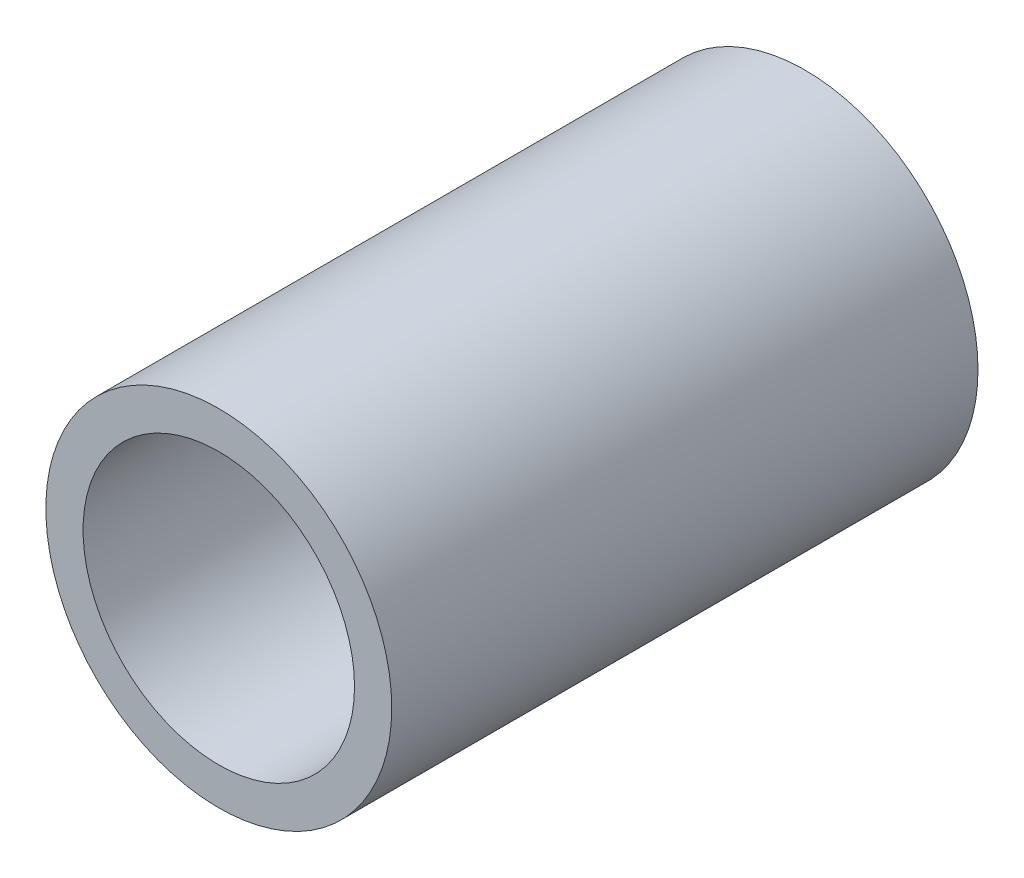
ISO-10303-21;
HEADER;
FILE_DESCRIPTION(('STEP AP214'),'2;1');
FILE_NAME('part.step','',(''),(''),'','','');
FILE_SCHEMA(('AUTOMOTIVE_DESIGN { 1 0 10303 214 1 1 1 1 }'));
ENDSEC;
DATA;
#1=APPLICATION_CONTEXT('core data for automotive mechanical design processes');
#2=APPLICATION_PROTOCOL_DEFINITION('international standard','automotive_design',2000,#1);
#3=PRODUCT_CONTEXT('',#1,'mechanical');
#4=PRODUCT('Part','Part','',(#3));
#5=PRODUCT_RELATED_PRODUCT_CATEGORY('part','',(#4));
#6=PRODUCT_DEFINITION_FORMATION('','',#4);
#7=PRODUCT_DEFINITION_CONTEXT('part definition',#1,'design');
#8=PRODUCT_DEFINITION('design','',#6,#7);
#9=PRODUCT_DEFINITION_SHAPE('','',#8);
#10=(LENGTH_UNIT() NAMED_UNIT(*) SI_UNIT(.MILLI.,.METRE.));
#11=(NAMED_UNIT(*) PLANE_ANGLE_UNIT() SI_UNIT($,.RADIAN.));
#12=(NAMED_UNIT(*) SI_UNIT($,.STERADIAN.) SOLID_ANGLE_UNIT());
#13=UNCERTAINTY_MEASURE_WITH_UNIT(LENGTH_MEASURE(1.E-05),#10,'distance_accuracy_value','');
#14=(GEOMETRIC_REPRESENTATION_CONTEXT(3) GLOBAL_UNCERTAINTY_ASSIGNED_CONTEXT((#13)) GLOBAL_UNIT_ASSIGNED_CONTEXT((#10,
#11,#12)) REPRESENTATION_CONTEXT('',''));
#15=CARTESIAN_POINT('',(0.,0.,0.));
#16=DIRECTION('',(0.,0.,1.));
#17=DIRECTION('',(1.,0.,0.));
#18=AXIS2_PLACEMENT_3D('',#15,#16,#17);
#19=CARTESIAN_POINT('',(0.,0.,762.));
#20=DIRECTION('',(0.,0.,-1.));
#21=DIRECTION('',(-1.,0.,0.));
#22=AXIS2_PLACEMENT_3D('',#19,#20,#21);
#23=CYLINDRICAL_SURFACE('',#22,13.335);
#24=CARTESIAN_POINT('',(0.,0.,-762.));
#25=DIRECTION('',(0.,0.,1.));
#26=DIRECTION('',(1.,0.,0.));
#27=AXIS2_PLACEMENT_3D('',#24,#25,#26);
#28=CIRCLE('',#27,13.335);
#29=CARTESIAN_POINT('',(13.335,0.,-762.));
#30=VERTEX_POINT('',#29);
#31=EDGE_CURVE('E11',#30,#30,#28,.T.);
#32=ORIENTED_EDGE('',*,*,#31,.T.);
#33=EDGE_LOOP('',(#32));
#34=FACE_BOUND('',#33,.T.);
#35=CARTESIAN_POINT('',(0.,0.,-716.7969));
#36=DIRECTION('',(0.,0.,1.));
#37=DIRECTION('',(1.,0.,0.));
#38=AXIS2_PLACEMENT_3D('',#35,#36,#37);
#39=CIRCLE('',#38,13.335);
#40=CARTESIAN_POINT('',(13.335,0.,-716.7969));
#41=VERTEX_POINT('',#40);
#42=EDGE_CURVE('E58',#41,#41,#39,.F.);
#43=ORIENTED_EDGE('',*,*,#42,.T.);
#44=EDGE_LOOP('',(#43));
#45=FACE_BOUND('',#44,.T.);
#46=ADVANCED_FACE('F43',(#34,#45),#23,.T.);
#47=CARTESIAN_POINT('',(0.,0.,762.));
#48=DIRECTION('',(0.,0.,-1.));
#49=DIRECTION('',(-1.,0.,0.));
#50=AXIS2_PLACEMENT_3D('',#47,#48,#49);
#51=CYLINDRICAL_SURFACE('',#50,10.4648);
#52=CARTESIAN_POINT('',(0.,0.,-762.));
#53=DIRECTION('',(0.,0.,1.));
#54=DIRECTION('',(1.,0.,0.));
#55=AXIS2_PLACEMENT_3D('',#52,#53,#54);
#56=CIRCLE('',#55,10.4648);
#57=CARTESIAN_POINT('',(10.4648,0.,-762.));
#58=VERTEX_POINT('',#57);
#59=EDGE_CURVE('E51',#58,#58,#56,.T.);
#60=ORIENTED_EDGE('',*,*,#59,.F.);
#61=EDGE_LOOP('',(#60));
#62=FACE_BOUND('',#61,.T.);
#63=CARTESIAN_POINT('',(0.,0.,-716.7969));
#64=DIRECTION('',(0.,0.,1.));
#65=DIRECTION('',(1.,0.,0.));
#66=AXIS2_PLACEMENT_3D('',#63,#64,#65);
#67=CIRCLE('',#66,10.4648);
#68=CARTESIAN_POINT('',(10.4648,0.,-716.7969));
#69=VERTEX_POINT('',#68);
#70=EDGE_CURVE('E46',#69,#69,#67,.T.);
#71=ORIENTED_EDGE('',*,*,#70,.T.);
#72=EDGE_LOOP('',(#71));
#73=FACE_BOUND('',#72,.T.);
#74=ADVANCED_FACE('F67',(#62,#73),#51,.F.);
#75=CARTESIAN_POINT('',(0.,0.,-762.));
#76=DIRECTION('',(0.,0.,1.));
#77=DIRECTION('',(1.,0.,0.));
#78=AXIS2_PLACEMENT_3D('',#75,#76,#77);
#79=PLANE('',#78);
#80=ORIENTED_EDGE('',*,*,#59,.T.);
#81=EDGE_LOOP('',(#80));
#82=FACE_BOUND('',#81,.T.);
#83=ORIENTED_EDGE('',*,*,#31,.F.);
#84=EDGE_LOOP('',(#83));
#85=FACE_BOUND('',#84,.T.);
#86=ADVANCED_FACE('F72',(#82,#85),#79,.F.);
#87=CARTESIAN_POINT('',(0.,0.,-716.7969));
#88=DIRECTION('',(0.,0.,1.));
#89=DIRECTION('',(1.,0.,0.));
#90=AXIS2_PLACEMENT_3D('',#87,#88,#89);
#91=PLANE('',#90);
#92=ORIENTED_EDGE('',*,*,#70,.F.);
#93=EDGE_LOOP('',(#92));
#94=FACE_BOUND('',#93,.T.);
#95=ORIENTED_EDGE('',*,*,#42,.F.);
#96=EDGE_LOOP('',(#95));
#97=FACE_BOUND('',#96,.T.);
#98=ADVANCED_FACE('F69',(#94,#97),#91,.T.);
#99=CLOSED_SHELL('',(#46,#74,#86,#98));
#100=MANIFOLD_SOLID_BREP('B2',#99);
#101=ADVANCED_BREP_SHAPE_REPRESENTATION('',(#18,#100),#14);
#102=SHAPE_DEFINITION_REPRESENTATION(#9,#101);
ENDSEC;
END-ISO-10303-21;
